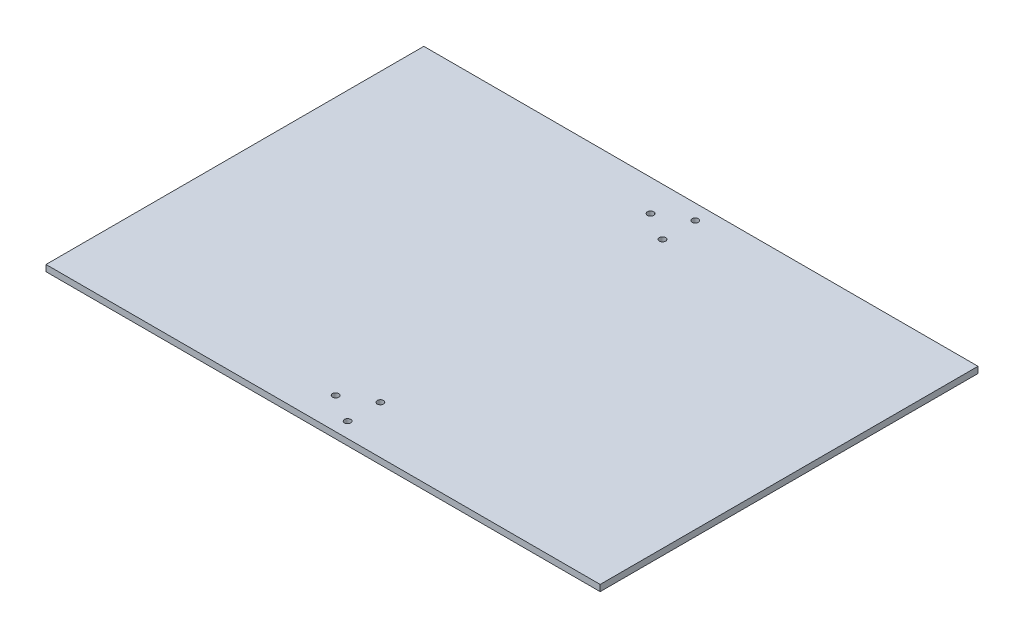
ISO-10303-21;
HEADER;
FILE_DESCRIPTION(('STEP AP214'),'2;1');
FILE_NAME('part.step','',(''),(''),'','','');
FILE_SCHEMA(('AUTOMOTIVE_DESIGN { 1 0 10303 214 1 1 1 1 }'));
ENDSEC;
DATA;
#1=APPLICATION_CONTEXT('core data for automotive mechanical design processes');
#2=APPLICATION_PROTOCOL_DEFINITION('international standard','automotive_design',2000,#1);
#3=PRODUCT_CONTEXT('',#1,'mechanical');
#4=PRODUCT('Part','Part','',(#3));
#5=PRODUCT_RELATED_PRODUCT_CATEGORY('part','',(#4));
#6=PRODUCT_DEFINITION_FORMATION('','',#4);
#7=PRODUCT_DEFINITION_CONTEXT('part definition',#1,'design');
#8=PRODUCT_DEFINITION('design','',#6,#7);
#9=PRODUCT_DEFINITION_SHAPE('','',#8);
#10=(LENGTH_UNIT() NAMED_UNIT(*) SI_UNIT(.MILLI.,.METRE.));
#11=(NAMED_UNIT(*) PLANE_ANGLE_UNIT() SI_UNIT($,.RADIAN.));
#12=(NAMED_UNIT(*) SI_UNIT($,.STERADIAN.) SOLID_ANGLE_UNIT());
#13=UNCERTAINTY_MEASURE_WITH_UNIT(LENGTH_MEASURE(1.E-05),#10,'distance_accuracy_value','');
#14=(GEOMETRIC_REPRESENTATION_CONTEXT(3) GLOBAL_UNCERTAINTY_ASSIGNED_CONTEXT((#13)) GLOBAL_UNIT_ASSIGNED_CONTEXT((#10,
#11,#12)) REPRESENTATION_CONTEXT('',''));
#15=CARTESIAN_POINT('',(0.,0.,0.));
#16=DIRECTION('',(0.,0.,1.));
#17=DIRECTION('',(1.,0.,0.));
#18=AXIS2_PLACEMENT_3D('',#15,#16,#17);
#19=CARTESIAN_POINT('',(0.,0.,0.));
#20=DIRECTION('',(0.,1.,0.));
#21=DIRECTION('',(0.,0.,1.));
#22=AXIS2_PLACEMENT_3D('',#19,#20,#21);
#23=PLANE('',#22);
#24=CARTESIAN_POINT('',(-38.1,0.,-317.5));
#25=DIRECTION('',(0.,1.,0.));
#26=DIRECTION('',(0.,0.,1.));
#27=AXIS2_PLACEMENT_3D('',#24,#25,#26);
#28=CIRCLE('',#27,6.35);
#29=CARTESIAN_POINT('',(-38.1,0.,-311.15));
#30=VERTEX_POINT('',#29);
#31=EDGE_CURVE('E132',#30,#30,#28,.T.);
#32=ORIENTED_EDGE('',*,*,#31,.F.);
#33=EDGE_LOOP('',(#32));
#34=FACE_BOUND('',#33,.T.);
#35=CARTESIAN_POINT('',(19.0500000000001,0.,-350.495567884187));
#36=DIRECTION('',(0.,1.,0.));
#37=DIRECTION('',(0.,0.,1.));
#38=AXIS2_PLACEMENT_3D('',#35,#36,#37);
#39=CIRCLE('',#38,6.35);
#40=CARTESIAN_POINT('',(19.0500000000001,0.,-344.145567884187));
#41=VERTEX_POINT('',#40);
#42=EDGE_CURVE('E151',#41,#41,#39,.T.);
#43=ORIENTED_EDGE('',*,*,#42,.F.);
#44=EDGE_LOOP('',(#43));
#45=FACE_BOUND('',#44,.T.);
#46=CARTESIAN_POINT('',(-38.1,0.,317.5));
#47=DIRECTION('',(0.,-1.,0.));
#48=DIRECTION('',(0.,0.,-1.));
#49=AXIS2_PLACEMENT_3D('',#46,#47,#48);
#50=CIRCLE('',#49,6.35);
#51=CARTESIAN_POINT('',(-38.1,0.,311.15));
#52=VERTEX_POINT('',#51);
#53=EDGE_CURVE('E138',#52,#52,#50,.T.);
#54=ORIENTED_EDGE('',*,*,#53,.T.);
#55=EDGE_LOOP('',(#54));
#56=FACE_BOUND('',#55,.T.);
#57=DIRECTION('',(0.,0.,1.));
#58=VECTOR('',#57,1.);
#59=CARTESIAN_POINT('',(558.8,0.,0.));
#60=LINE('',#59,#58);
#61=CARTESIAN_POINT('',(558.8,0.,-381.));
#62=VERTEX_POINT('',#61);
#63=CARTESIAN_POINT('',(558.8,0.,381.));
#64=VERTEX_POINT('',#63);
#65=EDGE_CURVE('E117',#62,#64,#60,.T.);
#66=ORIENTED_EDGE('',*,*,#65,.F.);
#67=DIRECTION('',(1.,0.,0.));
#68=VECTOR('',#67,1.);
#69=CARTESIAN_POINT('',(0.,0.,-381.));
#70=LINE('',#69,#68);
#71=CARTESIAN_POINT('',(-558.8,0.,-381.));
#72=VERTEX_POINT('',#71);
#73=EDGE_CURVE('E119',#72,#62,#70,.T.);
#74=ORIENTED_EDGE('',*,*,#73,.F.);
#75=DIRECTION('',(0.,0.,1.));
#76=VECTOR('',#75,1.);
#77=CARTESIAN_POINT('',(-558.8,0.,0.));
#78=LINE('',#77,#76);
#79=CARTESIAN_POINT('',(-558.8,0.,381.));
#80=VERTEX_POINT('',#79);
#81=EDGE_CURVE('E104',#72,#80,#78,.T.);
#82=ORIENTED_EDGE('',*,*,#81,.T.);
#83=DIRECTION('',(1.,0.,0.));
#84=VECTOR('',#83,1.);
#85=CARTESIAN_POINT('',(0.,0.,381.));
#86=LINE('',#85,#84);
#87=EDGE_CURVE('E123',#80,#64,#86,.T.);
#88=ORIENTED_EDGE('',*,*,#87,.T.);
#89=EDGE_LOOP('',(#66,#74,#82,#88));
#90=FACE_BOUND('',#89,.T.);
#91=CARTESIAN_POINT('',(19.0499999999997,0.,-284.504432115813));
#92=DIRECTION('',(0.,1.,0.));
#93=DIRECTION('',(0.,0.,1.));
#94=AXIS2_PLACEMENT_3D('',#91,#92,#93);
#95=CIRCLE('',#94,6.35);
#96=CARTESIAN_POINT('',(19.0499999999997,0.,-278.154432115813));
#97=VERTEX_POINT('',#96);
#98=EDGE_CURVE('E129',#97,#97,#95,.T.);
#99=ORIENTED_EDGE('',*,*,#98,.F.);
#100=EDGE_LOOP('',(#99));
#101=FACE_BOUND('',#100,.T.);
#102=CARTESIAN_POINT('',(19.0499999999997,0.,284.504432115813));
#103=DIRECTION('',(0.,-1.,0.));
#104=DIRECTION('',(0.,0.,-1.));
#105=AXIS2_PLACEMENT_3D('',#102,#103,#104);
#106=CIRCLE('',#105,6.35);
#107=CARTESIAN_POINT('',(19.0499999999997,0.,278.154432115813));
#108=VERTEX_POINT('',#107);
#109=EDGE_CURVE('E139',#108,#108,#106,.T.);
#110=ORIENTED_EDGE('',*,*,#109,.T.);
#111=EDGE_LOOP('',(#110));
#112=FACE_BOUND('',#111,.T.);
#113=CARTESIAN_POINT('',(19.0500000000001,0.,350.495567884187));
#114=DIRECTION('',(0.,-1.,0.));
#115=DIRECTION('',(0.,0.,-1.));
#116=AXIS2_PLACEMENT_3D('',#113,#114,#115);
#117=CIRCLE('',#116,6.35);
#118=CARTESIAN_POINT('',(19.0500000000001,0.,344.145567884187));
#119=VERTEX_POINT('',#118);
#120=EDGE_CURVE('E145',#119,#119,#117,.T.);
#121=ORIENTED_EDGE('',*,*,#120,.T.);
#122=EDGE_LOOP('',(#121));
#123=FACE_BOUND('',#122,.T.);
#124=ADVANCED_FACE('F53',(#34,#45,#56,#90,#101,#112,#123),#23,.T.);
#125=CARTESIAN_POINT('',(0.,-12.7,0.));
#126=DIRECTION('',(0.,1.,0.));
#127=DIRECTION('',(0.,0.,1.));
#128=AXIS2_PLACEMENT_3D('',#125,#126,#127);
#129=PLANE('',#128);
#130=CARTESIAN_POINT('',(-38.1,-12.7,-317.5));
#131=DIRECTION('',(0.,1.,0.));
#132=DIRECTION('',(0.,0.,1.));
#133=AXIS2_PLACEMENT_3D('',#130,#131,#132);
#134=CIRCLE('',#133,6.35);
#135=CARTESIAN_POINT('',(-38.1,-12.7,-311.15));
#136=VERTEX_POINT('',#135);
#137=EDGE_CURVE('E154',#136,#136,#134,.T.);
#138=ORIENTED_EDGE('',*,*,#137,.T.);
#139=EDGE_LOOP('',(#138));
#140=FACE_BOUND('',#139,.T.);
#141=CARTESIAN_POINT('',(19.0500000000001,-12.7,-350.495567884187));
#142=DIRECTION('',(0.,1.,0.));
#143=DIRECTION('',(0.,0.,1.));
#144=AXIS2_PLACEMENT_3D('',#141,#142,#143);
#145=CIRCLE('',#144,6.35);
#146=CARTESIAN_POINT('',(19.0500000000001,-12.7,-344.145567884187));
#147=VERTEX_POINT('',#146);
#148=EDGE_CURVE('E148',#147,#147,#145,.T.);
#149=ORIENTED_EDGE('',*,*,#148,.T.);
#150=EDGE_LOOP('',(#149));
#151=FACE_BOUND('',#150,.T.);
#152=CARTESIAN_POINT('',(19.0499999999997,-12.7,-284.504432115813));
#153=DIRECTION('',(0.,1.,0.));
#154=DIRECTION('',(0.,0.,1.));
#155=AXIS2_PLACEMENT_3D('',#152,#153,#154);
#156=CIRCLE('',#155,6.35);
#157=CARTESIAN_POINT('',(19.0499999999997,-12.7,-278.154432115813));
#158=VERTEX_POINT('',#157);
#159=EDGE_CURVE('E120',#158,#158,#156,.T.);
#160=ORIENTED_EDGE('',*,*,#159,.T.);
#161=EDGE_LOOP('',(#160));
#162=FACE_BOUND('',#161,.T.);
#163=DIRECTION('',(0.,0.,1.));
#164=VECTOR('',#163,1.);
#165=CARTESIAN_POINT('',(558.8,-12.7,0.));
#166=LINE('',#165,#164);
#167=CARTESIAN_POINT('',(558.8,-12.7,-381.));
#168=VERTEX_POINT('',#167);
#169=CARTESIAN_POINT('',(558.8,-12.7,381.));
#170=VERTEX_POINT('',#169);
#171=EDGE_CURVE('E72',#168,#170,#166,.T.);
#172=ORIENTED_EDGE('',*,*,#171,.T.);
#173=DIRECTION('',(1.,0.,0.));
#174=VECTOR('',#173,1.);
#175=CARTESIAN_POINT('',(0.,-12.7,381.));
#176=LINE('',#175,#174);
#177=CARTESIAN_POINT('',(-558.8,-12.7,381.));
#178=VERTEX_POINT('',#177);
#179=EDGE_CURVE('E112',#178,#170,#176,.T.);
#180=ORIENTED_EDGE('',*,*,#179,.F.);
#181=DIRECTION('',(0.,0.,1.));
#182=VECTOR('',#181,1.);
#183=CARTESIAN_POINT('',(-558.8,-12.7,0.));
#184=LINE('',#183,#182);
#185=CARTESIAN_POINT('',(-558.8,-12.7,-381.));
#186=VERTEX_POINT('',#185);
#187=EDGE_CURVE('E103',#186,#178,#184,.T.);
#188=ORIENTED_EDGE('',*,*,#187,.F.);
#189=DIRECTION('',(1.,0.,0.));
#190=VECTOR('',#189,1.);
#191=CARTESIAN_POINT('',(0.,-12.7,-381.));
#192=LINE('',#191,#190);
#193=EDGE_CURVE('E98',#186,#168,#192,.T.);
#194=ORIENTED_EDGE('',*,*,#193,.T.);
#195=EDGE_LOOP('',(#172,#180,#188,#194));
#196=FACE_BOUND('',#195,.T.);
#197=CARTESIAN_POINT('',(19.0499999999997,-12.7,284.504432115813));
#198=DIRECTION('',(0.,-1.,0.));
#199=DIRECTION('',(0.,0.,-1.));
#200=AXIS2_PLACEMENT_3D('',#197,#198,#199);
#201=CIRCLE('',#200,6.35);
#202=CARTESIAN_POINT('',(19.0499999999997,-12.7,278.154432115813));
#203=VERTEX_POINT('',#202);
#204=EDGE_CURVE('E159',#203,#203,#201,.T.);
#205=ORIENTED_EDGE('',*,*,#204,.F.);
#206=EDGE_LOOP('',(#205));
#207=FACE_BOUND('',#206,.T.);
#208=CARTESIAN_POINT('',(-38.1,-12.7,317.5));
#209=DIRECTION('',(0.,-1.,0.));
#210=DIRECTION('',(0.,0.,-1.));
#211=AXIS2_PLACEMENT_3D('',#208,#209,#210);
#212=CIRCLE('',#211,6.35);
#213=CARTESIAN_POINT('',(-38.1,-12.7,311.15));
#214=VERTEX_POINT('',#213);
#215=EDGE_CURVE('E135',#214,#214,#212,.T.);
#216=ORIENTED_EDGE('',*,*,#215,.F.);
#217=EDGE_LOOP('',(#216));
#218=FACE_BOUND('',#217,.T.);
#219=CARTESIAN_POINT('',(19.0500000000001,-12.7,350.495567884187));
#220=DIRECTION('',(0.,-1.,0.));
#221=DIRECTION('',(0.,0.,-1.));
#222=AXIS2_PLACEMENT_3D('',#219,#220,#221);
#223=CIRCLE('',#222,6.35);
#224=CARTESIAN_POINT('',(19.0500000000001,-12.7,344.145567884187));
#225=VERTEX_POINT('',#224);
#226=EDGE_CURVE('E142',#225,#225,#223,.T.);
#227=ORIENTED_EDGE('',*,*,#226,.F.);
#228=EDGE_LOOP('',(#227));
#229=FACE_BOUND('',#228,.T.);
#230=ADVANCED_FACE('F110',(#140,#151,#162,#196,#207,#218,#229),#129,.F.);
#231=CARTESIAN_POINT('',(0.,-12.7,381.));
#232=DIRECTION('',(0.,0.,1.));
#233=DIRECTION('',(1.,0.,0.));
#234=AXIS2_PLACEMENT_3D('',#231,#232,#233);
#235=PLANE('',#234);
#236=ORIENTED_EDGE('',*,*,#87,.F.);
#237=DIRECTION('',(0.,1.,0.));
#238=VECTOR('',#237,1.);
#239=CARTESIAN_POINT('',(-558.8,-12.7,381.));
#240=LINE('',#239,#238);
#241=EDGE_CURVE('E63',#178,#80,#240,.T.);
#242=ORIENTED_EDGE('',*,*,#241,.F.);
#243=ORIENTED_EDGE('',*,*,#179,.T.);
#244=DIRECTION('',(0.,1.,0.));
#245=VECTOR('',#244,1.);
#246=CARTESIAN_POINT('',(558.8,-12.7,381.));
#247=LINE('',#246,#245);
#248=EDGE_CURVE('E12',#170,#64,#247,.T.);
#249=ORIENTED_EDGE('',*,*,#248,.T.);
#250=EDGE_LOOP('',(#236,#242,#243,#249));
#251=FACE_BOUND('',#250,.T.);
#252=ADVANCED_FACE('F188',(#251),#235,.T.);
#253=CARTESIAN_POINT('',(-558.8,-12.7,0.));
#254=DIRECTION('',(-1.,0.,0.));
#255=DIRECTION('',(0.,0.,1.));
#256=AXIS2_PLACEMENT_3D('',#253,#254,#255);
#257=PLANE('',#256);
#258=ORIENTED_EDGE('',*,*,#81,.F.);
#259=DIRECTION('',(0.,1.,0.));
#260=VECTOR('',#259,1.);
#261=CARTESIAN_POINT('',(-558.8,-12.7,-381.));
#262=LINE('',#261,#260);
#263=EDGE_CURVE('E101',#186,#72,#262,.T.);
#264=ORIENTED_EDGE('',*,*,#263,.F.);
#265=ORIENTED_EDGE('',*,*,#187,.T.);
#266=ORIENTED_EDGE('',*,*,#241,.T.);
#267=EDGE_LOOP('',(#258,#264,#265,#266));
#268=FACE_BOUND('',#267,.T.);
#269=ADVANCED_FACE('F102',(#268),#257,.T.);
#270=CARTESIAN_POINT('',(0.,-12.7,-381.));
#271=DIRECTION('',(0.,0.,1.));
#272=DIRECTION('',(1.,0.,0.));
#273=AXIS2_PLACEMENT_3D('',#270,#271,#272);
#274=PLANE('',#273);
#275=ORIENTED_EDGE('',*,*,#73,.T.);
#276=DIRECTION('',(0.,1.,0.));
#277=VECTOR('',#276,1.);
#278=CARTESIAN_POINT('',(558.8,-12.7,-381.));
#279=LINE('',#278,#277);
#280=EDGE_CURVE('E57',#168,#62,#279,.T.);
#281=ORIENTED_EDGE('',*,*,#280,.F.);
#282=ORIENTED_EDGE('',*,*,#193,.F.);
#283=ORIENTED_EDGE('',*,*,#263,.T.);
#284=EDGE_LOOP('',(#275,#281,#282,#283));
#285=FACE_BOUND('',#284,.T.);
#286=ADVANCED_FACE('F107',(#285),#274,.F.);
#287=CARTESIAN_POINT('',(558.8,-12.7,0.));
#288=DIRECTION('',(-1.,0.,0.));
#289=DIRECTION('',(0.,0.,1.));
#290=AXIS2_PLACEMENT_3D('',#287,#288,#289);
#291=PLANE('',#290);
#292=ORIENTED_EDGE('',*,*,#65,.T.);
#293=ORIENTED_EDGE('',*,*,#248,.F.);
#294=ORIENTED_EDGE('',*,*,#171,.F.);
#295=ORIENTED_EDGE('',*,*,#280,.T.);
#296=EDGE_LOOP('',(#292,#293,#294,#295));
#297=FACE_BOUND('',#296,.T.);
#298=ADVANCED_FACE('F55',(#297),#291,.F.);
#299=CARTESIAN_POINT('',(19.0499999999997,-12.7,-284.504432115813));
#300=DIRECTION('',(0.,1.,0.));
#301=DIRECTION('',(0.,0.,1.));
#302=AXIS2_PLACEMENT_3D('',#299,#300,#301);
#303=CYLINDRICAL_SURFACE('',#302,6.35);
#304=ORIENTED_EDGE('',*,*,#159,.F.);
#305=EDGE_LOOP('',(#304));
#306=FACE_BOUND('',#305,.T.);
#307=ORIENTED_EDGE('',*,*,#98,.T.);
#308=EDGE_LOOP('',(#307));
#309=FACE_BOUND('',#308,.T.);
#310=ADVANCED_FACE('F170',(#306,#309),#303,.F.);
#311=CARTESIAN_POINT('',(19.0499999999997,-12.7,284.504432115813));
#312=DIRECTION('',(0.,1.,0.));
#313=DIRECTION('',(0.,0.,1.));
#314=AXIS2_PLACEMENT_3D('',#311,#312,#313);
#315=CYLINDRICAL_SURFACE('',#314,6.35);
#316=ORIENTED_EDGE('',*,*,#204,.T.);
#317=EDGE_LOOP('',(#316));
#318=FACE_BOUND('',#317,.T.);
#319=ORIENTED_EDGE('',*,*,#109,.F.);
#320=EDGE_LOOP('',(#319));
#321=FACE_BOUND('',#320,.T.);
#322=ADVANCED_FACE('F167',(#318,#321),#315,.F.);
#323=CARTESIAN_POINT('',(-38.1,-12.7,317.5));
#324=DIRECTION('',(0.,1.,0.));
#325=DIRECTION('',(0.,0.,1.));
#326=AXIS2_PLACEMENT_3D('',#323,#324,#325);
#327=CYLINDRICAL_SURFACE('',#326,6.35);
#328=ORIENTED_EDGE('',*,*,#215,.T.);
#329=EDGE_LOOP('',(#328));
#330=FACE_BOUND('',#329,.T.);
#331=ORIENTED_EDGE('',*,*,#53,.F.);
#332=EDGE_LOOP('',(#331));
#333=FACE_BOUND('',#332,.T.);
#334=ADVANCED_FACE('F169',(#330,#333),#327,.F.);
#335=CARTESIAN_POINT('',(19.0500000000001,-12.7,350.495567884187));
#336=DIRECTION('',(0.,1.,0.));
#337=DIRECTION('',(0.,0.,1.));
#338=AXIS2_PLACEMENT_3D('',#335,#336,#337);
#339=CYLINDRICAL_SURFACE('',#338,6.35);
#340=ORIENTED_EDGE('',*,*,#226,.T.);
#341=EDGE_LOOP('',(#340));
#342=FACE_BOUND('',#341,.T.);
#343=ORIENTED_EDGE('',*,*,#120,.F.);
#344=EDGE_LOOP('',(#343));
#345=FACE_BOUND('',#344,.T.);
#346=ADVANCED_FACE('F177',(#342,#345),#339,.F.);
#347=CARTESIAN_POINT('',(19.0500000000001,-12.7,-350.495567884187));
#348=DIRECTION('',(0.,1.,0.));
#349=DIRECTION('',(0.,0.,1.));
#350=AXIS2_PLACEMENT_3D('',#347,#348,#349);
#351=CYLINDRICAL_SURFACE('',#350,6.35);
#352=ORIENTED_EDGE('',*,*,#148,.F.);
#353=EDGE_LOOP('',(#352));
#354=FACE_BOUND('',#353,.T.);
#355=ORIENTED_EDGE('',*,*,#42,.T.);
#356=EDGE_LOOP('',(#355));
#357=FACE_BOUND('',#356,.T.);
#358=ADVANCED_FACE('F235',(#354,#357),#351,.F.);
#359=CARTESIAN_POINT('',(-38.1,-12.7,-317.5));
#360=DIRECTION('',(0.,1.,0.));
#361=DIRECTION('',(0.,0.,1.));
#362=AXIS2_PLACEMENT_3D('',#359,#360,#361);
#363=CYLINDRICAL_SURFACE('',#362,6.35);
#364=ORIENTED_EDGE('',*,*,#137,.F.);
#365=EDGE_LOOP('',(#364));
#366=FACE_BOUND('',#365,.T.);
#367=ORIENTED_EDGE('',*,*,#31,.T.);
#368=EDGE_LOOP('',(#367));
#369=FACE_BOUND('',#368,.T.);
#370=ADVANCED_FACE('F245',(#366,#369),#363,.F.);
#371=CLOSED_SHELL('',(#124,#230,#252,#269,#286,#298,#310,#322,#334,#346,#358,#370));
#372=MANIFOLD_SOLID_BREP('B2',#371);
#373=ADVANCED_BREP_SHAPE_REPRESENTATION('',(#18,#372),#14);
#374=SHAPE_DEFINITION_REPRESENTATION(#9,#373);
ENDSEC;
END-ISO-10303-21;
